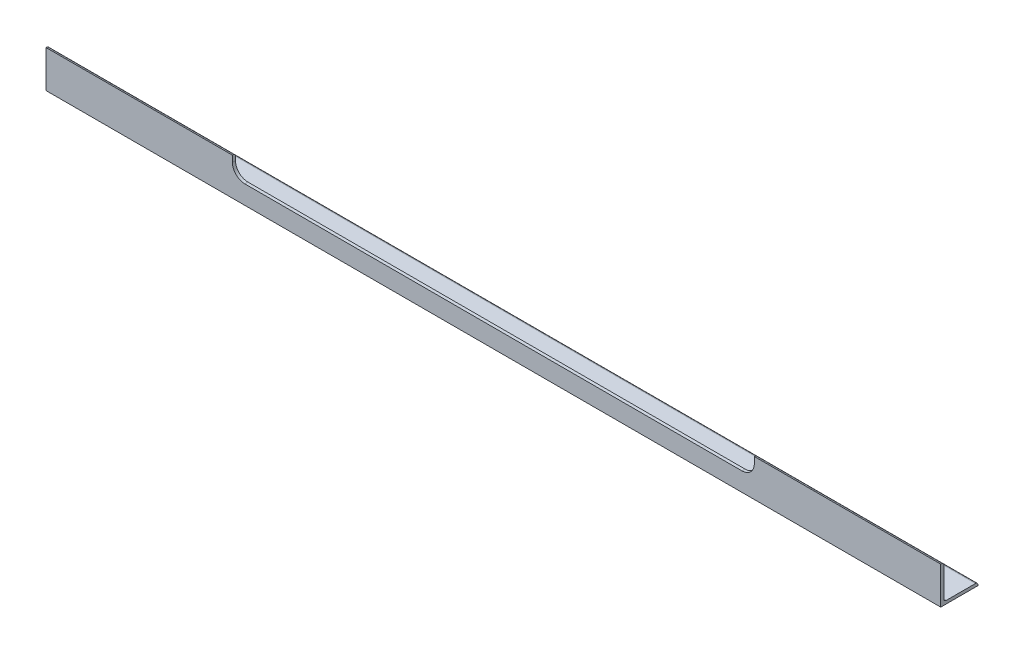
ISO-10303-21;
HEADER;
FILE_DESCRIPTION(('STEP AP214'),'2;1');
FILE_NAME('part.step','',(''),(''),'','','');
FILE_SCHEMA(('AUTOMOTIVE_DESIGN { 1 0 10303 214 1 1 1 1 }'));
ENDSEC;
DATA;
#1=APPLICATION_CONTEXT('core data for automotive mechanical design processes');
#2=APPLICATION_PROTOCOL_DEFINITION('international standard','automotive_design',2000,#1);
#3=PRODUCT_CONTEXT('',#1,'mechanical');
#4=PRODUCT('Part','Part','',(#3));
#5=PRODUCT_RELATED_PRODUCT_CATEGORY('part','',(#4));
#6=PRODUCT_DEFINITION_FORMATION('','',#4);
#7=PRODUCT_DEFINITION_CONTEXT('part definition',#1,'design');
#8=PRODUCT_DEFINITION('design','',#6,#7);
#9=PRODUCT_DEFINITION_SHAPE('','',#8);
#10=(LENGTH_UNIT() NAMED_UNIT(*) SI_UNIT(.MILLI.,.METRE.));
#11=(NAMED_UNIT(*) PLANE_ANGLE_UNIT() SI_UNIT($,.RADIAN.));
#12=(NAMED_UNIT(*) SI_UNIT($,.STERADIAN.) SOLID_ANGLE_UNIT());
#13=UNCERTAINTY_MEASURE_WITH_UNIT(LENGTH_MEASURE(1.E-05),#10,'distance_accuracy_value','');
#14=(GEOMETRIC_REPRESENTATION_CONTEXT(3) GLOBAL_UNCERTAINTY_ASSIGNED_CONTEXT((#13)) GLOBAL_UNIT_ASSIGNED_CONTEXT((#10,
#11,#12)) REPRESENTATION_CONTEXT('',''));
#15=CARTESIAN_POINT('',(0.,0.,0.));
#16=DIRECTION('',(0.,0.,1.));
#17=DIRECTION('',(1.,0.,0.));
#18=AXIS2_PLACEMENT_3D('',#15,#16,#17);
#19=CARTESIAN_POINT('',(-914.4,76.2,0.));
#20=DIRECTION('',(0.,1.,0.));
#21=DIRECTION('',(0.,0.,1.));
#22=AXIS2_PLACEMENT_3D('',#19,#20,#21);
#23=PLANE('',#22);
#24=DIRECTION('',(0.,0.,1.));
#25=VECTOR('',#24,1.);
#26=CARTESIAN_POINT('',(-533.4,76.2,-76.2));
#27=LINE('',#26,#25);
#28=CARTESIAN_POINT('',(-533.4,76.2,-1.27000000000002));
#29=VERTEX_POINT('',#28);
#30=CARTESIAN_POINT('',(-533.4,76.2,0.));
#31=VERTEX_POINT('',#30);
#32=EDGE_CURVE('E163',#29,#31,#27,.T.);
#33=ORIENTED_EDGE('',*,*,#32,.F.);
#34=DIRECTION('',(1.,0.,0.));
#35=VECTOR('',#34,1.);
#36=CARTESIAN_POINT('',(-914.4,76.2,-1.26999999999996));
#37=LINE('',#36,#35);
#38=CARTESIAN_POINT('',(-914.4,76.2,-1.26999999999996));
#39=VERTEX_POINT('',#38);
#40=EDGE_CURVE('E182',#39,#29,#37,.T.);
#41=ORIENTED_EDGE('',*,*,#40,.F.);
#42=DIRECTION('',(0.,0.,1.));
#43=VECTOR('',#42,1.);
#44=CARTESIAN_POINT('',(-914.4,76.2,0.));
#45=LINE('',#44,#43);
#46=CARTESIAN_POINT('',(-914.4,76.2,0.));
#47=VERTEX_POINT('',#46);
#48=EDGE_CURVE('E244',#39,#47,#45,.T.);
#49=ORIENTED_EDGE('',*,*,#48,.T.);
#50=DIRECTION('',(1.,0.,0.));
#51=VECTOR('',#50,1.);
#52=CARTESIAN_POINT('',(-914.4,76.2,0.));
#53=LINE('',#52,#51);
#54=EDGE_CURVE('E169',#47,#31,#53,.T.);
#55=ORIENTED_EDGE('',*,*,#54,.T.);
#56=EDGE_LOOP('',(#33,#41,#49,#55));
#57=FACE_BOUND('',#56,.T.);
#58=ADVANCED_FACE('F33',(#57),#23,.T.);
#59=CARTESIAN_POINT('',(-914.4,71.12,-1.27));
#60=DIRECTION('',(1.,0.,0.));
#61=DIRECTION('',(0.,0.,-1.));
#62=AXIS2_PLACEMENT_3D('',#59,#60,#61);
#63=CYLINDRICAL_SURFACE('',#62,5.08);
#64=CARTESIAN_POINT('',(-533.4,71.12,-1.27));
#65=DIRECTION('',(-1.,0.,0.));
#66=DIRECTION('',(0.,0.,1.));
#67=AXIS2_PLACEMENT_3D('',#64,#65,#66);
#68=CIRCLE('',#67,5.08);
#69=CARTESIAN_POINT('',(-533.4,71.12,-6.35));
#70=VERTEX_POINT('',#69);
#71=EDGE_CURVE('E218',#70,#29,#68,.F.);
#72=ORIENTED_EDGE('',*,*,#71,.F.);
#73=DIRECTION('',(1.,0.,0.));
#74=VECTOR('',#73,1.);
#75=CARTESIAN_POINT('',(-914.4,71.12,-6.35));
#76=LINE('',#75,#74);
#77=CARTESIAN_POINT('',(-914.4,71.12,-6.35));
#78=VERTEX_POINT('',#77);
#79=EDGE_CURVE('E269',#78,#70,#76,.T.);
#80=ORIENTED_EDGE('',*,*,#79,.F.);
#81=CARTESIAN_POINT('',(-914.4,71.12,-1.27));
#82=DIRECTION('',(1.,0.,0.));
#83=DIRECTION('',(0.,0.,-1.));
#84=AXIS2_PLACEMENT_3D('',#81,#82,#83);
#85=CIRCLE('',#84,5.08);
#86=EDGE_CURVE('E170',#78,#39,#85,.T.);
#87=ORIENTED_EDGE('',*,*,#86,.T.);
#88=ORIENTED_EDGE('',*,*,#40,.T.);
#89=EDGE_LOOP('',(#72,#80,#87,#88));
#90=FACE_BOUND('',#89,.T.);
#91=ADVANCED_FACE('F302',(#90),#63,.T.);
#92=DIRECTION('',(0.,0.,1.));
#93=VECTOR('',#92,1.);
#94=CARTESIAN_POINT('',(533.4,76.2,-76.2));
#95=LINE('',#94,#93);
#96=CARTESIAN_POINT('',(533.4,76.2,-1.27));
#97=VERTEX_POINT('',#96);
#98=CARTESIAN_POINT('',(533.4,76.2,0.));
#99=VERTEX_POINT('',#98);
#100=EDGE_CURVE('E149',#97,#99,#95,.T.);
#101=ORIENTED_EDGE('',*,*,#100,.T.);
#102=CARTESIAN_POINT('',(914.4,76.2,0.));
#103=VERTEX_POINT('',#102);
#104=EDGE_CURVE('E160',#99,#103,#53,.T.);
#105=ORIENTED_EDGE('',*,*,#104,.T.);
#106=DIRECTION('',(0.,0.,1.));
#107=VECTOR('',#106,1.);
#108=CARTESIAN_POINT('',(914.4,76.2,0.));
#109=LINE('',#108,#107);
#110=CARTESIAN_POINT('',(914.4,76.2,-1.26999999999996));
#111=VERTEX_POINT('',#110);
#112=EDGE_CURVE('E220',#111,#103,#109,.T.);
#113=ORIENTED_EDGE('',*,*,#112,.F.);
#114=EDGE_CURVE('E162',#97,#111,#37,.T.);
#115=ORIENTED_EDGE('',*,*,#114,.F.);
#116=EDGE_LOOP('',(#101,#105,#113,#115));
#117=FACE_BOUND('',#116,.T.);
#118=ADVANCED_FACE('F158',(#117),#23,.T.);
#119=CARTESIAN_POINT('',(533.4,71.12,-1.27));
#120=DIRECTION('',(1.,0.,0.));
#121=DIRECTION('',(0.,0.,-1.));
#122=AXIS2_PLACEMENT_3D('',#119,#120,#121);
#123=CIRCLE('',#122,5.08);
#124=CARTESIAN_POINT('',(533.4,71.12,-6.35));
#125=VERTEX_POINT('',#124);
#126=EDGE_CURVE('E202',#97,#125,#123,.F.);
#127=ORIENTED_EDGE('',*,*,#126,.F.);
#128=ORIENTED_EDGE('',*,*,#114,.T.);
#129=CARTESIAN_POINT('',(914.4,71.12,-1.27));
#130=DIRECTION('',(1.,0.,0.));
#131=DIRECTION('',(0.,0.,-1.));
#132=AXIS2_PLACEMENT_3D('',#129,#130,#131);
#133=CIRCLE('',#132,5.08);
#134=CARTESIAN_POINT('',(914.4,71.12,-6.35));
#135=VERTEX_POINT('',#134);
#136=EDGE_CURVE('E241',#135,#111,#133,.T.);
#137=ORIENTED_EDGE('',*,*,#136,.F.);
#138=EDGE_CURVE('E272',#125,#135,#76,.T.);
#139=ORIENTED_EDGE('',*,*,#138,.F.);
#140=EDGE_LOOP('',(#127,#128,#137,#139));
#141=FACE_BOUND('',#140,.T.);
#142=ADVANCED_FACE('F310',(#141),#63,.T.);
#143=CARTESIAN_POINT('',(-914.4,71.12,-6.35));
#144=DIRECTION('',(0.,0.,-1.));
#145=DIRECTION('',(-1.,0.,0.));
#146=AXIS2_PLACEMENT_3D('',#143,#144,#145);
#147=PLANE('',#146);
#148=DIRECTION('',(0.,1.,0.));
#149=VECTOR('',#148,1.);
#150=CARTESIAN_POINT('',(-533.4,71.12,-6.35));
#151=LINE('',#150,#149);
#152=CARTESIAN_POINT('',(-533.4,63.5,-6.35));
#153=VERTEX_POINT('',#152);
#154=EDGE_CURVE('E216',#153,#70,#151,.T.);
#155=ORIENTED_EDGE('',*,*,#154,.F.);
#156=CARTESIAN_POINT('',(-508.,63.5,-6.34999999999999));
#157=DIRECTION('',(0.,0.,-1.));
#158=DIRECTION('',(-1.,0.,0.));
#159=AXIS2_PLACEMENT_3D('',#156,#157,#158);
#160=CIRCLE('',#159,25.4);
#161=CARTESIAN_POINT('',(-508.,38.1,-6.35));
#162=VERTEX_POINT('',#161);
#163=EDGE_CURVE('E11',#153,#162,#160,.F.);
#164=ORIENTED_EDGE('',*,*,#163,.T.);
#165=DIRECTION('',(-1.,0.,0.));
#166=VECTOR('',#165,1.);
#167=CARTESIAN_POINT('',(-914.4,38.1,-6.35));
#168=LINE('',#167,#166);
#169=CARTESIAN_POINT('',(508.,38.1,-6.35));
#170=VERTEX_POINT('',#169);
#171=EDGE_CURVE('E199',#170,#162,#168,.T.);
#172=ORIENTED_EDGE('',*,*,#171,.F.);
#173=CARTESIAN_POINT('',(508.,63.5,-6.34999999999999));
#174=DIRECTION('',(0.,0.,-1.));
#175=DIRECTION('',(-1.,0.,0.));
#176=AXIS2_PLACEMENT_3D('',#173,#174,#175);
#177=CIRCLE('',#176,25.4);
#178=CARTESIAN_POINT('',(533.4,63.5,-6.35));
#179=VERTEX_POINT('',#178);
#180=EDGE_CURVE('E190',#170,#179,#177,.F.);
#181=ORIENTED_EDGE('',*,*,#180,.T.);
#182=DIRECTION('',(0.,-1.,0.));
#183=VECTOR('',#182,1.);
#184=CARTESIAN_POINT('',(533.4,71.12,-6.35));
#185=LINE('',#184,#183);
#186=EDGE_CURVE('E196',#125,#179,#185,.T.);
#187=ORIENTED_EDGE('',*,*,#186,.F.);
#188=ORIENTED_EDGE('',*,*,#138,.T.);
#189=DIRECTION('',(0.,1.,0.));
#190=VECTOR('',#189,1.);
#191=CARTESIAN_POINT('',(914.4,71.12,-6.35));
#192=LINE('',#191,#190);
#193=CARTESIAN_POINT('',(914.4,11.43,-6.35));
#194=VERTEX_POINT('',#193);
#195=EDGE_CURVE('E238',#194,#135,#192,.T.);
#196=ORIENTED_EDGE('',*,*,#195,.F.);
#197=DIRECTION('',(1.,0.,0.));
#198=VECTOR('',#197,1.);
#199=CARTESIAN_POINT('',(-914.4,11.43,-6.35));
#200=LINE('',#199,#198);
#201=CARTESIAN_POINT('',(-914.4,11.43,-6.35));
#202=VERTEX_POINT('',#201);
#203=EDGE_CURVE('E273',#202,#194,#200,.T.);
#204=ORIENTED_EDGE('',*,*,#203,.F.);
#205=DIRECTION('',(0.,1.,0.));
#206=VECTOR('',#205,1.);
#207=CARTESIAN_POINT('',(-914.4,71.12,-6.35));
#208=LINE('',#207,#206);
#209=EDGE_CURVE('E175',#202,#78,#208,.T.);
#210=ORIENTED_EDGE('',*,*,#209,.T.);
#211=ORIENTED_EDGE('',*,*,#79,.T.);
#212=EDGE_LOOP('',(#155,#164,#172,#181,#187,#188,#196,#204,#210,#211));
#213=FACE_BOUND('',#212,.T.);
#214=ADVANCED_FACE('F195',(#213),#147,.T.);
#215=CARTESIAN_POINT('',(-914.4,11.43,-11.43));
#216=DIRECTION('',(1.,0.,0.));
#217=DIRECTION('',(0.,0.,-1.));
#218=AXIS2_PLACEMENT_3D('',#215,#216,#217);
#219=CYLINDRICAL_SURFACE('',#218,5.08);
#220=ORIENTED_EDGE('',*,*,#203,.T.);
#221=CARTESIAN_POINT('',(914.4,11.43,-11.43));
#222=DIRECTION('',(-1.,0.,0.));
#223=DIRECTION('',(0.,0.,-1.));
#224=AXIS2_PLACEMENT_3D('',#221,#222,#223);
#225=CIRCLE('',#224,5.08);
#226=CARTESIAN_POINT('',(914.4,6.35,-11.43));
#227=VERTEX_POINT('',#226);
#228=EDGE_CURVE('E235',#227,#194,#225,.T.);
#229=ORIENTED_EDGE('',*,*,#228,.F.);
#230=DIRECTION('',(1.,0.,0.));
#231=VECTOR('',#230,1.);
#232=CARTESIAN_POINT('',(-914.4,6.35,-11.43));
#233=LINE('',#232,#231);
#234=CARTESIAN_POINT('',(-914.4,6.35,-11.43));
#235=VERTEX_POINT('',#234);
#236=EDGE_CURVE('E275',#235,#227,#233,.T.);
#237=ORIENTED_EDGE('',*,*,#236,.F.);
#238=CARTESIAN_POINT('',(-914.4,11.43,-11.43));
#239=DIRECTION('',(-1.,0.,0.));
#240=DIRECTION('',(0.,0.,-1.));
#241=AXIS2_PLACEMENT_3D('',#238,#239,#240);
#242=CIRCLE('',#241,5.08);
#243=EDGE_CURVE('E262',#235,#202,#242,.T.);
#244=ORIENTED_EDGE('',*,*,#243,.T.);
#245=EDGE_LOOP('',(#220,#229,#237,#244));
#246=FACE_BOUND('',#245,.T.);
#247=ADVANCED_FACE('F320',(#246),#219,.F.);
#248=CARTESIAN_POINT('',(-914.4,6.35,-11.43));
#249=DIRECTION('',(0.,1.,0.));
#250=DIRECTION('',(0.,0.,1.));
#251=AXIS2_PLACEMENT_3D('',#248,#249,#250);
#252=PLANE('',#251);
#253=ORIENTED_EDGE('',*,*,#236,.T.);
#254=DIRECTION('',(0.,0.,1.));
#255=VECTOR('',#254,1.);
#256=CARTESIAN_POINT('',(914.4,6.35,-11.43));
#257=LINE('',#256,#255);
#258=CARTESIAN_POINT('',(914.4,6.35,-71.12));
#259=VERTEX_POINT('',#258);
#260=EDGE_CURVE('E232',#259,#227,#257,.T.);
#261=ORIENTED_EDGE('',*,*,#260,.F.);
#262=DIRECTION('',(1.,0.,0.));
#263=VECTOR('',#262,1.);
#264=CARTESIAN_POINT('',(-914.4,6.35,-71.12));
#265=LINE('',#264,#263);
#266=CARTESIAN_POINT('',(-914.4,6.35,-71.12));
#267=VERTEX_POINT('',#266);
#268=EDGE_CURVE('E277',#267,#259,#265,.T.);
#269=ORIENTED_EDGE('',*,*,#268,.F.);
#270=DIRECTION('',(0.,0.,1.));
#271=VECTOR('',#270,1.);
#272=CARTESIAN_POINT('',(-914.4,6.35,-11.43));
#273=LINE('',#272,#271);
#274=EDGE_CURVE('E259',#267,#235,#273,.T.);
#275=ORIENTED_EDGE('',*,*,#274,.T.);
#276=EDGE_LOOP('',(#253,#261,#269,#275));
#277=FACE_BOUND('',#276,.T.);
#278=ADVANCED_FACE('F327',(#277),#252,.T.);
#279=CARTESIAN_POINT('',(-914.4,1.27,-71.12));
#280=DIRECTION('',(1.,0.,0.));
#281=DIRECTION('',(0.,0.,-1.));
#282=AXIS2_PLACEMENT_3D('',#279,#280,#281);
#283=CYLINDRICAL_SURFACE('',#282,5.08);
#284=ORIENTED_EDGE('',*,*,#268,.T.);
#285=CARTESIAN_POINT('',(914.4,1.27,-71.12));
#286=DIRECTION('',(1.,0.,0.));
#287=DIRECTION('',(0.,0.,1.));
#288=AXIS2_PLACEMENT_3D('',#285,#286,#287);
#289=CIRCLE('',#288,5.08);
#290=CARTESIAN_POINT('',(914.4,1.26999999999996,-76.2));
#291=VERTEX_POINT('',#290);
#292=EDGE_CURVE('E229',#291,#259,#289,.T.);
#293=ORIENTED_EDGE('',*,*,#292,.F.);
#294=DIRECTION('',(1.,0.,0.));
#295=VECTOR('',#294,1.);
#296=CARTESIAN_POINT('',(-914.4,1.26999999999996,-76.2));
#297=LINE('',#296,#295);
#298=CARTESIAN_POINT('',(-914.4,1.26999999999996,-76.2));
#299=VERTEX_POINT('',#298);
#300=EDGE_CURVE('E279',#299,#291,#297,.T.);
#301=ORIENTED_EDGE('',*,*,#300,.F.);
#302=CARTESIAN_POINT('',(-914.4,1.27,-71.12));
#303=DIRECTION('',(1.,0.,0.));
#304=DIRECTION('',(0.,0.,1.));
#305=AXIS2_PLACEMENT_3D('',#302,#303,#304);
#306=CIRCLE('',#305,5.08);
#307=EDGE_CURVE('E256',#299,#267,#306,.T.);
#308=ORIENTED_EDGE('',*,*,#307,.T.);
#309=EDGE_LOOP('',(#284,#293,#301,#308));
#310=FACE_BOUND('',#309,.T.);
#311=ADVANCED_FACE('F298',(#310),#283,.T.);
#312=CARTESIAN_POINT('',(-914.4,1.26999999999996,-76.2));
#313=DIRECTION('',(0.,0.,-1.));
#314=DIRECTION('',(-1.,0.,0.));
#315=AXIS2_PLACEMENT_3D('',#312,#313,#314);
#316=PLANE('',#315);
#317=ORIENTED_EDGE('',*,*,#300,.T.);
#318=DIRECTION('',(0.,1.,0.));
#319=VECTOR('',#318,1.);
#320=CARTESIAN_POINT('',(914.4,1.26999999999996,-76.2));
#321=LINE('',#320,#319);
#322=CARTESIAN_POINT('',(914.4,0.,-76.2));
#323=VERTEX_POINT('',#322);
#324=EDGE_CURVE('E226',#323,#291,#321,.T.);
#325=ORIENTED_EDGE('',*,*,#324,.F.);
#326=DIRECTION('',(1.,0.,0.));
#327=VECTOR('',#326,1.);
#328=CARTESIAN_POINT('',(-914.4,0.,-76.2));
#329=LINE('',#328,#327);
#330=CARTESIAN_POINT('',(-914.4,0.,-76.2));
#331=VERTEX_POINT('',#330);
#332=EDGE_CURVE('E280',#331,#323,#329,.T.);
#333=ORIENTED_EDGE('',*,*,#332,.F.);
#334=DIRECTION('',(0.,1.,0.));
#335=VECTOR('',#334,1.);
#336=CARTESIAN_POINT('',(-914.4,1.26999999999996,-76.2));
#337=LINE('',#336,#335);
#338=EDGE_CURVE('E253',#331,#299,#337,.T.);
#339=ORIENTED_EDGE('',*,*,#338,.T.);
#340=EDGE_LOOP('',(#317,#325,#333,#339));
#341=FACE_BOUND('',#340,.T.);
#342=ADVANCED_FACE('F290',(#341),#316,.T.);
#343=CARTESIAN_POINT('',(-914.4,0.,0.));
#344=DIRECTION('',(0.,-1.,0.));
#345=DIRECTION('',(0.,0.,-1.));
#346=AXIS2_PLACEMENT_3D('',#343,#344,#345);
#347=PLANE('',#346);
#348=ORIENTED_EDGE('',*,*,#332,.T.);
#349=DIRECTION('',(0.,0.,-1.));
#350=VECTOR('',#349,1.);
#351=CARTESIAN_POINT('',(914.4,0.,0.));
#352=LINE('',#351,#350);
#353=CARTESIAN_POINT('',(914.4,0.,0.));
#354=VERTEX_POINT('',#353);
#355=EDGE_CURVE('E223',#354,#323,#352,.T.);
#356=ORIENTED_EDGE('',*,*,#355,.F.);
#357=DIRECTION('',(1.,0.,0.));
#358=VECTOR('',#357,1.);
#359=CARTESIAN_POINT('',(-914.4,0.,0.));
#360=LINE('',#359,#358);
#361=CARTESIAN_POINT('',(-914.4,0.,0.));
#362=VERTEX_POINT('',#361);
#363=EDGE_CURVE('E173',#362,#354,#360,.T.);
#364=ORIENTED_EDGE('',*,*,#363,.F.);
#365=DIRECTION('',(0.,0.,-1.));
#366=VECTOR('',#365,1.);
#367=CARTESIAN_POINT('',(-914.4,0.,0.));
#368=LINE('',#367,#366);
#369=EDGE_CURVE('E250',#362,#331,#368,.T.);
#370=ORIENTED_EDGE('',*,*,#369,.T.);
#371=EDGE_LOOP('',(#348,#356,#364,#370));
#372=FACE_BOUND('',#371,.T.);
#373=ADVANCED_FACE('F288',(#372),#347,.T.);
#374=CARTESIAN_POINT('',(-914.4,76.2,0.));
#375=DIRECTION('',(0.,0.,1.));
#376=DIRECTION('',(1.,0.,0.));
#377=AXIS2_PLACEMENT_3D('',#374,#375,#376);
#378=PLANE('',#377);
#379=DIRECTION('',(0.,-1.,0.));
#380=VECTOR('',#379,1.);
#381=CARTESIAN_POINT('',(-533.4,76.2,0.));
#382=LINE('',#381,#380);
#383=CARTESIAN_POINT('',(-533.4,63.5,0.));
#384=VERTEX_POINT('',#383);
#385=EDGE_CURVE('E209',#31,#384,#382,.T.);
#386=ORIENTED_EDGE('',*,*,#385,.F.);
#387=ORIENTED_EDGE('',*,*,#54,.F.);
#388=DIRECTION('',(0.,-1.,0.));
#389=VECTOR('',#388,1.);
#390=CARTESIAN_POINT('',(-914.4,76.2,0.));
#391=LINE('',#390,#389);
#392=EDGE_CURVE('E247',#47,#362,#391,.T.);
#393=ORIENTED_EDGE('',*,*,#392,.T.);
#394=ORIENTED_EDGE('',*,*,#363,.T.);
#395=DIRECTION('',(0.,-1.,0.));
#396=VECTOR('',#395,1.);
#397=CARTESIAN_POINT('',(914.4,76.2,0.));
#398=LINE('',#397,#396);
#399=EDGE_CURVE('E167',#103,#354,#398,.T.);
#400=ORIENTED_EDGE('',*,*,#399,.F.);
#401=ORIENTED_EDGE('',*,*,#104,.F.);
#402=DIRECTION('',(0.,1.,0.));
#403=VECTOR('',#402,1.);
#404=CARTESIAN_POINT('',(533.4,76.2,0.));
#405=LINE('',#404,#403);
#406=CARTESIAN_POINT('',(533.4,63.5,0.));
#407=VERTEX_POINT('',#406);
#408=EDGE_CURVE('E145',#407,#99,#405,.T.);
#409=ORIENTED_EDGE('',*,*,#408,.F.);
#410=CARTESIAN_POINT('',(508.,63.5,0.));
#411=DIRECTION('',(0.,0.,1.));
#412=DIRECTION('',(1.,0.,0.));
#413=AXIS2_PLACEMENT_3D('',#410,#411,#412);
#414=CIRCLE('',#413,25.4);
#415=CARTESIAN_POINT('',(508.,38.1,0.));
#416=VERTEX_POINT('',#415);
#417=EDGE_CURVE('E188',#407,#416,#414,.F.);
#418=ORIENTED_EDGE('',*,*,#417,.T.);
#419=DIRECTION('',(1.,0.,0.));
#420=VECTOR('',#419,1.);
#421=CARTESIAN_POINT('',(-533.4,38.1,0.));
#422=LINE('',#421,#420);
#423=CARTESIAN_POINT('',(-508.,38.1,0.));
#424=VERTEX_POINT('',#423);
#425=EDGE_CURVE('E154',#424,#416,#422,.T.);
#426=ORIENTED_EDGE('',*,*,#425,.F.);
#427=CARTESIAN_POINT('',(-508.,63.5,0.));
#428=DIRECTION('',(0.,0.,1.));
#429=DIRECTION('',(1.,0.,0.));
#430=AXIS2_PLACEMENT_3D('',#427,#428,#429);
#431=CIRCLE('',#430,25.4);
#432=EDGE_CURVE('E41',#424,#384,#431,.F.);
#433=ORIENTED_EDGE('',*,*,#432,.T.);
#434=EDGE_LOOP('',(#386,#387,#393,#394,#400,#401,#409,#418,#426,#433));
#435=FACE_BOUND('',#434,.T.);
#436=ADVANCED_FACE('F165',(#435),#378,.T.);
#437=CARTESIAN_POINT('',(-914.4,71.12,-1.27));
#438=DIRECTION('',(1.,0.,0.));
#439=DIRECTION('',(0.,0.,-1.));
#440=AXIS2_PLACEMENT_3D('',#437,#438,#439);
#441=PLANE('',#440);
#442=ORIENTED_EDGE('',*,*,#48,.F.);
#443=ORIENTED_EDGE('',*,*,#86,.F.);
#444=ORIENTED_EDGE('',*,*,#209,.F.);
#445=ORIENTED_EDGE('',*,*,#243,.F.);
#446=ORIENTED_EDGE('',*,*,#274,.F.);
#447=ORIENTED_EDGE('',*,*,#307,.F.);
#448=ORIENTED_EDGE('',*,*,#338,.F.);
#449=ORIENTED_EDGE('',*,*,#369,.F.);
#450=ORIENTED_EDGE('',*,*,#392,.F.);
#451=EDGE_LOOP('',(#442,#443,#444,#445,#446,#447,#448,#449,#450));
#452=FACE_BOUND('',#451,.T.);
#453=ADVANCED_FACE('F296',(#452),#441,.F.);
#454=CARTESIAN_POINT('',(914.4,71.12,-1.27));
#455=DIRECTION('',(1.,0.,0.));
#456=DIRECTION('',(0.,0.,-1.));
#457=AXIS2_PLACEMENT_3D('',#454,#455,#456);
#458=PLANE('',#457);
#459=ORIENTED_EDGE('',*,*,#112,.T.);
#460=ORIENTED_EDGE('',*,*,#399,.T.);
#461=ORIENTED_EDGE('',*,*,#355,.T.);
#462=ORIENTED_EDGE('',*,*,#324,.T.);
#463=ORIENTED_EDGE('',*,*,#292,.T.);
#464=ORIENTED_EDGE('',*,*,#260,.T.);
#465=ORIENTED_EDGE('',*,*,#228,.T.);
#466=ORIENTED_EDGE('',*,*,#195,.T.);
#467=ORIENTED_EDGE('',*,*,#136,.T.);
#468=EDGE_LOOP('',(#459,#460,#461,#462,#463,#464,#465,#466,#467));
#469=FACE_BOUND('',#468,.T.);
#470=ADVANCED_FACE('F286',(#469),#458,.T.);
#471=CARTESIAN_POINT('',(-533.4,76.2,-76.2));
#472=DIRECTION('',(-1.,0.,0.));
#473=DIRECTION('',(0.,0.,1.));
#474=AXIS2_PLACEMENT_3D('',#471,#472,#473);
#475=PLANE('',#474);
#476=ORIENTED_EDGE('',*,*,#385,.T.);
#477=DIRECTION('',(0.,0.,1.));
#478=VECTOR('',#477,1.);
#479=CARTESIAN_POINT('',(-533.4,63.5,-6.35000000000002));
#480=LINE('',#479,#478);
#481=EDGE_CURVE('E48',#384,#153,#480,.F.);
#482=ORIENTED_EDGE('',*,*,#481,.T.);
#483=ORIENTED_EDGE('',*,*,#154,.T.);
#484=ORIENTED_EDGE('',*,*,#71,.T.);
#485=ORIENTED_EDGE('',*,*,#32,.T.);
#486=EDGE_LOOP('',(#476,#482,#483,#484,#485));
#487=FACE_BOUND('',#486,.T.);
#488=ADVANCED_FACE('F350',(#487),#475,.F.);
#489=CARTESIAN_POINT('',(533.4,76.2,-76.2));
#490=DIRECTION('',(1.,0.,0.));
#491=DIRECTION('',(0.,0.,-1.));
#492=AXIS2_PLACEMENT_3D('',#489,#490,#491);
#493=PLANE('',#492);
#494=ORIENTED_EDGE('',*,*,#186,.T.);
#495=DIRECTION('',(0.,0.,1.));
#496=VECTOR('',#495,1.);
#497=CARTESIAN_POINT('',(533.4,63.5,0.));
#498=LINE('',#497,#496);
#499=EDGE_CURVE('E152',#179,#407,#498,.T.);
#500=ORIENTED_EDGE('',*,*,#499,.T.);
#501=ORIENTED_EDGE('',*,*,#408,.T.);
#502=ORIENTED_EDGE('',*,*,#100,.F.);
#503=ORIENTED_EDGE('',*,*,#126,.T.);
#504=EDGE_LOOP('',(#494,#500,#501,#502,#503));
#505=FACE_BOUND('',#504,.T.);
#506=ADVANCED_FACE('F148',(#505),#493,.F.);
#507=CARTESIAN_POINT('',(-533.4,38.1,-76.2));
#508=DIRECTION('',(0.,-1.,0.));
#509=DIRECTION('',(0.,0.,-1.));
#510=AXIS2_PLACEMENT_3D('',#507,#508,#509);
#511=PLANE('',#510);
#512=ORIENTED_EDGE('',*,*,#425,.T.);
#513=DIRECTION('',(0.,0.,1.));
#514=VECTOR('',#513,1.);
#515=CARTESIAN_POINT('',(508.,38.1,-6.35000000000002));
#516=LINE('',#515,#514);
#517=EDGE_CURVE('E185',#416,#170,#516,.F.);
#518=ORIENTED_EDGE('',*,*,#517,.T.);
#519=ORIENTED_EDGE('',*,*,#171,.T.);
#520=DIRECTION('',(0.,0.,1.));
#521=VECTOR('',#520,1.);
#522=CARTESIAN_POINT('',(-508.,38.1,0.));
#523=LINE('',#522,#521);
#524=EDGE_CURVE('E181',#162,#424,#523,.T.);
#525=ORIENTED_EDGE('',*,*,#524,.T.);
#526=EDGE_LOOP('',(#512,#518,#519,#525));
#527=FACE_BOUND('',#526,.T.);
#528=ADVANCED_FACE('F207',(#527),#511,.F.);
#529=CARTESIAN_POINT('',(508.,63.5,-76.2));
#530=DIRECTION('',(0.,0.,-1.));
#531=DIRECTION('',(-1.,0.,0.));
#532=AXIS2_PLACEMENT_3D('',#529,#530,#531);
#533=CYLINDRICAL_SURFACE('',#532,25.4);
#534=ORIENTED_EDGE('',*,*,#180,.F.);
#535=ORIENTED_EDGE('',*,*,#517,.F.);
#536=ORIENTED_EDGE('',*,*,#417,.F.);
#537=ORIENTED_EDGE('',*,*,#499,.F.);
#538=EDGE_LOOP('',(#534,#535,#536,#537));
#539=FACE_BOUND('',#538,.T.);
#540=ADVANCED_FACE('F204',(#539),#533,.F.);
#541=CARTESIAN_POINT('',(-508.,63.5,-76.2));
#542=DIRECTION('',(0.,0.,-1.));
#543=DIRECTION('',(-1.,0.,0.));
#544=AXIS2_PLACEMENT_3D('',#541,#542,#543);
#545=CYLINDRICAL_SURFACE('',#544,25.4);
#546=ORIENTED_EDGE('',*,*,#163,.F.);
#547=ORIENTED_EDGE('',*,*,#481,.F.);
#548=ORIENTED_EDGE('',*,*,#432,.F.);
#549=ORIENTED_EDGE('',*,*,#524,.F.);
#550=EDGE_LOOP('',(#546,#547,#548,#549));
#551=FACE_BOUND('',#550,.T.);
#552=ADVANCED_FACE('F35',(#551),#545,.F.);
#553=CLOSED_SHELL('',(#58,#91,#118,#142,#214,#247,#278,#311,#342,#373,#436,#453,#470,#488,#506,
#528,#540,#552));
#554=MANIFOLD_SOLID_BREP('B2',#553);
#555=ADVANCED_BREP_SHAPE_REPRESENTATION('',(#18,#554),#14);
#556=SHAPE_DEFINITION_REPRESENTATION(#9,#555);
ENDSEC;
END-ISO-10303-21;
